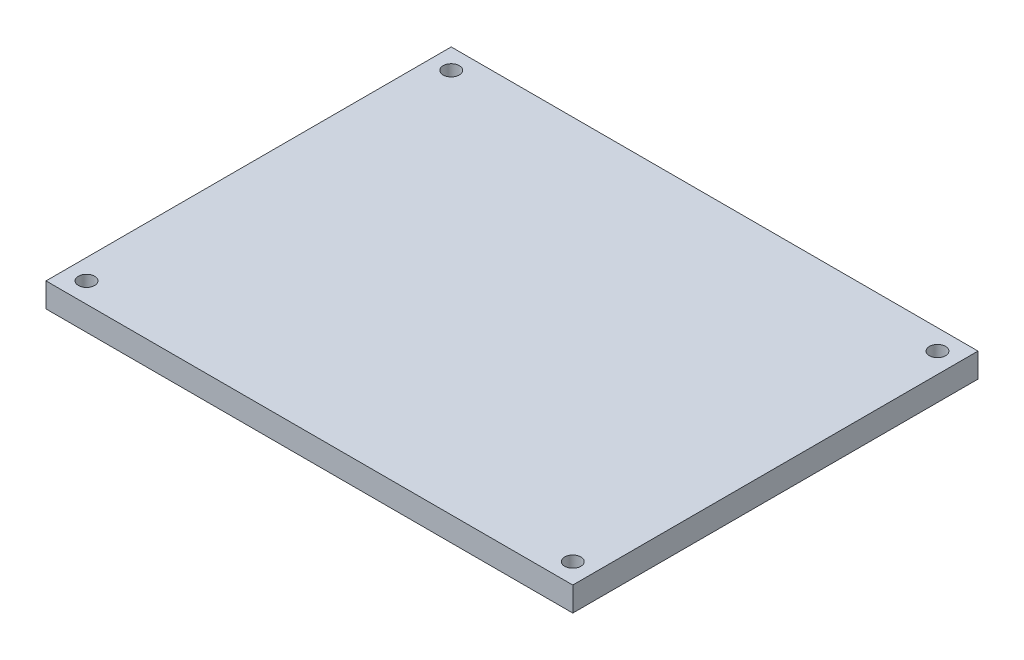
ISO-10303-21;
HEADER;
FILE_DESCRIPTION(('STEP AP214'),'2;1');
FILE_NAME('part.step','',(''),(''),'','','');
FILE_SCHEMA(('AUTOMOTIVE_DESIGN { 1 0 10303 214 1 1 1 1 }'));
ENDSEC;
DATA;
#1=APPLICATION_CONTEXT('core data for automotive mechanical design processes');
#2=APPLICATION_PROTOCOL_DEFINITION('international standard','automotive_design',2000,#1);
#3=PRODUCT_CONTEXT('',#1,'mechanical');
#4=PRODUCT('Part','Part','',(#3));
#5=PRODUCT_RELATED_PRODUCT_CATEGORY('part','',(#4));
#6=PRODUCT_DEFINITION_FORMATION('','',#4);
#7=PRODUCT_DEFINITION_CONTEXT('part definition',#1,'design');
#8=PRODUCT_DEFINITION('design','',#6,#7);
#9=PRODUCT_DEFINITION_SHAPE('','',#8);
#10=(LENGTH_UNIT() NAMED_UNIT(*) SI_UNIT(.MILLI.,.METRE.));
#11=(NAMED_UNIT(*) PLANE_ANGLE_UNIT() SI_UNIT($,.RADIAN.));
#12=(NAMED_UNIT(*) SI_UNIT($,.STERADIAN.) SOLID_ANGLE_UNIT());
#13=UNCERTAINTY_MEASURE_WITH_UNIT(LENGTH_MEASURE(1.E-05),#10,'distance_accuracy_value','');
#14=(GEOMETRIC_REPRESENTATION_CONTEXT(3) GLOBAL_UNCERTAINTY_ASSIGNED_CONTEXT((#13)) GLOBAL_UNIT_ASSIGNED_CONTEXT((#10,
#11,#12)) REPRESENTATION_CONTEXT('',''));
#15=CARTESIAN_POINT('',(0.,0.,0.));
#16=DIRECTION('',(0.,0.,1.));
#17=DIRECTION('',(1.,0.,0.));
#18=AXIS2_PLACEMENT_3D('',#15,#16,#17);
#19=CARTESIAN_POINT('',(65.,6.,-50.));
#20=DIRECTION('',(-1.,0.,0.));
#21=DIRECTION('',(0.,0.,1.));
#22=AXIS2_PLACEMENT_3D('',#19,#20,#21);
#23=PLANE('',#22);
#24=DIRECTION('',(0.,0.,-1.));
#25=VECTOR('',#24,1.);
#26=CARTESIAN_POINT('',(65.,0.,-50.));
#27=LINE('',#26,#25);
#28=CARTESIAN_POINT('',(65.,0.,50.));
#29=VERTEX_POINT('',#28);
#30=CARTESIAN_POINT('',(65.,0.,-50.));
#31=VERTEX_POINT('',#30);
#32=EDGE_CURVE('E95',#29,#31,#27,.T.);
#33=ORIENTED_EDGE('',*,*,#32,.T.);
#34=DIRECTION('',(0.,-1.,0.));
#35=VECTOR('',#34,1.);
#36=CARTESIAN_POINT('',(65.,6.,-50.));
#37=LINE('',#36,#35);
#38=CARTESIAN_POINT('',(65.,6.,-50.));
#39=VERTEX_POINT('',#38);
#40=EDGE_CURVE('E11',#39,#31,#37,.T.);
#41=ORIENTED_EDGE('',*,*,#40,.F.);
#42=DIRECTION('',(0.,0.,-1.));
#43=VECTOR('',#42,1.);
#44=CARTESIAN_POINT('',(65.,6.,-50.));
#45=LINE('',#44,#43);
#46=CARTESIAN_POINT('',(65.,6.,50.));
#47=VERTEX_POINT('',#46);
#48=EDGE_CURVE('E83',#47,#39,#45,.T.);
#49=ORIENTED_EDGE('',*,*,#48,.F.);
#50=DIRECTION('',(0.,-1.,0.));
#51=VECTOR('',#50,1.);
#52=CARTESIAN_POINT('',(65.,6.,50.));
#53=LINE('',#52,#51);
#54=EDGE_CURVE('E91',#47,#29,#53,.T.);
#55=ORIENTED_EDGE('',*,*,#54,.T.);
#56=EDGE_LOOP('',(#33,#41,#49,#55));
#57=FACE_BOUND('',#56,.T.);
#58=ADVANCED_FACE('F32',(#57),#23,.F.);
#59=CARTESIAN_POINT('',(-65.,6.,-50.));
#60=DIRECTION('',(0.,0.,1.));
#61=DIRECTION('',(1.,0.,0.));
#62=AXIS2_PLACEMENT_3D('',#59,#60,#61);
#63=PLANE('',#62);
#64=DIRECTION('',(-1.,0.,0.));
#65=VECTOR('',#64,1.);
#66=CARTESIAN_POINT('',(-65.,0.,-50.));
#67=LINE('',#66,#65);
#68=CARTESIAN_POINT('',(-65.,0.,-50.));
#69=VERTEX_POINT('',#68);
#70=EDGE_CURVE('E87',#31,#69,#67,.T.);
#71=ORIENTED_EDGE('',*,*,#70,.T.);
#72=DIRECTION('',(0.,-1.,0.));
#73=VECTOR('',#72,1.);
#74=CARTESIAN_POINT('',(-65.,6.,-50.));
#75=LINE('',#74,#73);
#76=CARTESIAN_POINT('',(-65.,6.,-50.));
#77=VERTEX_POINT('',#76);
#78=EDGE_CURVE('E40',#77,#69,#75,.T.);
#79=ORIENTED_EDGE('',*,*,#78,.F.);
#80=DIRECTION('',(-1.,0.,0.));
#81=VECTOR('',#80,1.);
#82=CARTESIAN_POINT('',(-65.,6.,-50.));
#83=LINE('',#82,#81);
#84=EDGE_CURVE('E78',#39,#77,#83,.T.);
#85=ORIENTED_EDGE('',*,*,#84,.F.);
#86=ORIENTED_EDGE('',*,*,#40,.T.);
#87=EDGE_LOOP('',(#71,#79,#85,#86));
#88=FACE_BOUND('',#87,.T.);
#89=ADVANCED_FACE('F86',(#88),#63,.F.);
#90=CARTESIAN_POINT('',(-65.,6.,-50.));
#91=DIRECTION('',(1.,0.,0.));
#92=DIRECTION('',(0.,0.,-1.));
#93=AXIS2_PLACEMENT_3D('',#90,#91,#92);
#94=PLANE('',#93);
#95=DIRECTION('',(0.,0.,1.));
#96=VECTOR('',#95,1.);
#97=CARTESIAN_POINT('',(-65.,0.,-50.));
#98=LINE('',#97,#96);
#99=CARTESIAN_POINT('',(-64.9999999999999,0.,50.));
#100=VERTEX_POINT('',#99);
#101=EDGE_CURVE('E65',#69,#100,#98,.T.);
#102=ORIENTED_EDGE('',*,*,#101,.T.);
#103=DIRECTION('',(0.,-1.,0.));
#104=VECTOR('',#103,1.);
#105=CARTESIAN_POINT('',(-64.9999999999999,6.,50.));
#106=LINE('',#105,#104);
#107=CARTESIAN_POINT('',(-64.9999999999999,6.,50.));
#108=VERTEX_POINT('',#107);
#109=EDGE_CURVE('E88',#108,#100,#106,.T.);
#110=ORIENTED_EDGE('',*,*,#109,.F.);
#111=DIRECTION('',(0.,0.,1.));
#112=VECTOR('',#111,1.);
#113=CARTESIAN_POINT('',(-65.,6.,-50.));
#114=LINE('',#113,#112);
#115=EDGE_CURVE('E81',#77,#108,#114,.T.);
#116=ORIENTED_EDGE('',*,*,#115,.F.);
#117=ORIENTED_EDGE('',*,*,#78,.T.);
#118=EDGE_LOOP('',(#102,#110,#116,#117));
#119=FACE_BOUND('',#118,.T.);
#120=ADVANCED_FACE('F89',(#119),#94,.F.);
#121=CARTESIAN_POINT('',(-64.9999999999999,6.,50.));
#122=DIRECTION('',(0.,0.,-1.));
#123=DIRECTION('',(-1.,0.,0.));
#124=AXIS2_PLACEMENT_3D('',#121,#122,#123);
#125=PLANE('',#124);
#126=DIRECTION('',(1.,0.,0.));
#127=VECTOR('',#126,1.);
#128=CARTESIAN_POINT('',(-64.9999999999999,0.,50.));
#129=LINE('',#128,#127);
#130=EDGE_CURVE('E71',#100,#29,#129,.T.);
#131=ORIENTED_EDGE('',*,*,#130,.T.);
#132=ORIENTED_EDGE('',*,*,#54,.F.);
#133=DIRECTION('',(1.,0.,0.));
#134=VECTOR('',#133,1.);
#135=CARTESIAN_POINT('',(-64.9999999999999,6.,50.));
#136=LINE('',#135,#134);
#137=EDGE_CURVE('E48',#108,#47,#136,.T.);
#138=ORIENTED_EDGE('',*,*,#137,.F.);
#139=ORIENTED_EDGE('',*,*,#109,.T.);
#140=EDGE_LOOP('',(#131,#132,#138,#139));
#141=FACE_BOUND('',#140,.T.);
#142=ADVANCED_FACE('F103',(#141),#125,.F.);
#143=CARTESIAN_POINT('',(0.,6.,0.));
#144=DIRECTION('',(0.,1.,0.));
#145=DIRECTION('',(0.,0.,1.));
#146=AXIS2_PLACEMENT_3D('',#143,#144,#145);
#147=PLANE('',#146);
#148=CARTESIAN_POINT('',(-60.,6.,45.));
#149=DIRECTION('',(0.,1.,0.));
#150=DIRECTION('',(0.,0.,-1.));
#151=AXIS2_PLACEMENT_3D('',#148,#149,#150);
#152=CIRCLE('',#151,2.);
#153=CARTESIAN_POINT('',(-60.,6.,43.));
#154=VERTEX_POINT('',#153);
#155=EDGE_CURVE('E127',#154,#154,#152,.T.);
#156=ORIENTED_EDGE('',*,*,#155,.F.);
#157=EDGE_LOOP('',(#156));
#158=FACE_BOUND('',#157,.T.);
#159=CARTESIAN_POINT('',(60.,6.,45.));
#160=DIRECTION('',(0.,1.,0.));
#161=DIRECTION('',(0.,0.,1.));
#162=AXIS2_PLACEMENT_3D('',#159,#160,#161);
#163=CIRCLE('',#162,2.);
#164=CARTESIAN_POINT('',(60.,6.,47.));
#165=VERTEX_POINT('',#164);
#166=EDGE_CURVE('E121',#165,#165,#163,.T.);
#167=ORIENTED_EDGE('',*,*,#166,.F.);
#168=EDGE_LOOP('',(#167));
#169=FACE_BOUND('',#168,.T.);
#170=CARTESIAN_POINT('',(60.,6.,-45.));
#171=DIRECTION('',(0.,1.,0.));
#172=DIRECTION('',(0.,0.,-1.));
#173=AXIS2_PLACEMENT_3D('',#170,#171,#172);
#174=CIRCLE('',#173,2.);
#175=CARTESIAN_POINT('',(60.,6.,-47.));
#176=VERTEX_POINT('',#175);
#177=EDGE_CURVE('E115',#176,#176,#174,.T.);
#178=ORIENTED_EDGE('',*,*,#177,.F.);
#179=EDGE_LOOP('',(#178));
#180=FACE_BOUND('',#179,.T.);
#181=CARTESIAN_POINT('',(-60.,6.,-45.));
#182=DIRECTION('',(0.,1.,0.));
#183=DIRECTION('',(0.,0.,1.));
#184=AXIS2_PLACEMENT_3D('',#181,#182,#183);
#185=CIRCLE('',#184,2.);
#186=CARTESIAN_POINT('',(-60.,6.,-43.));
#187=VERTEX_POINT('',#186);
#188=EDGE_CURVE('E109',#187,#187,#185,.T.);
#189=ORIENTED_EDGE('',*,*,#188,.F.);
#190=EDGE_LOOP('',(#189));
#191=FACE_BOUND('',#190,.T.);
#192=ORIENTED_EDGE('',*,*,#48,.T.);
#193=ORIENTED_EDGE('',*,*,#84,.T.);
#194=ORIENTED_EDGE('',*,*,#115,.T.);
#195=ORIENTED_EDGE('',*,*,#137,.T.);
#196=EDGE_LOOP('',(#192,#193,#194,#195));
#197=FACE_BOUND('',#196,.T.);
#198=ADVANCED_FACE('F79',(#158,#169,#180,#191,#197),#147,.T.);
#199=CARTESIAN_POINT('',(0.,0.,0.));
#200=DIRECTION('',(0.,1.,0.));
#201=DIRECTION('',(0.,0.,1.));
#202=AXIS2_PLACEMENT_3D('',#199,#200,#201);
#203=PLANE('',#202);
#204=CARTESIAN_POINT('',(-60.,0.,45.));
#205=DIRECTION('',(0.,1.,0.));
#206=DIRECTION('',(0.,0.,-1.));
#207=AXIS2_PLACEMENT_3D('',#204,#205,#206);
#208=CIRCLE('',#207,2.);
#209=CARTESIAN_POINT('',(-60.,0.,43.));
#210=VERTEX_POINT('',#209);
#211=EDGE_CURVE('E112',#210,#210,#208,.T.);
#212=ORIENTED_EDGE('',*,*,#211,.T.);
#213=EDGE_LOOP('',(#212));
#214=FACE_BOUND('',#213,.T.);
#215=CARTESIAN_POINT('',(60.,0.,45.));
#216=DIRECTION('',(0.,1.,0.));
#217=DIRECTION('',(0.,0.,1.));
#218=AXIS2_PLACEMENT_3D('',#215,#216,#217);
#219=CIRCLE('',#218,2.);
#220=CARTESIAN_POINT('',(60.,0.,47.));
#221=VERTEX_POINT('',#220);
#222=EDGE_CURVE('E124',#221,#221,#219,.T.);
#223=ORIENTED_EDGE('',*,*,#222,.T.);
#224=EDGE_LOOP('',(#223));
#225=FACE_BOUND('',#224,.T.);
#226=CARTESIAN_POINT('',(60.,0.,-45.));
#227=DIRECTION('',(0.,1.,0.));
#228=DIRECTION('',(0.,0.,-1.));
#229=AXIS2_PLACEMENT_3D('',#226,#227,#228);
#230=CIRCLE('',#229,2.);
#231=CARTESIAN_POINT('',(60.,0.,-47.));
#232=VERTEX_POINT('',#231);
#233=EDGE_CURVE('E118',#232,#232,#230,.T.);
#234=ORIENTED_EDGE('',*,*,#233,.T.);
#235=EDGE_LOOP('',(#234));
#236=FACE_BOUND('',#235,.T.);
#237=CARTESIAN_POINT('',(-60.,0.,-45.));
#238=DIRECTION('',(0.,1.,0.));
#239=DIRECTION('',(0.,0.,1.));
#240=AXIS2_PLACEMENT_3D('',#237,#238,#239);
#241=CIRCLE('',#240,2.);
#242=CARTESIAN_POINT('',(-60.,0.,-43.));
#243=VERTEX_POINT('',#242);
#244=EDGE_CURVE('E98',#243,#243,#241,.T.);
#245=ORIENTED_EDGE('',*,*,#244,.T.);
#246=EDGE_LOOP('',(#245));
#247=FACE_BOUND('',#246,.T.);
#248=ORIENTED_EDGE('',*,*,#32,.F.);
#249=ORIENTED_EDGE('',*,*,#130,.F.);
#250=ORIENTED_EDGE('',*,*,#101,.F.);
#251=ORIENTED_EDGE('',*,*,#70,.F.);
#252=EDGE_LOOP('',(#248,#249,#250,#251));
#253=FACE_BOUND('',#252,.T.);
#254=ADVANCED_FACE('F106',(#214,#225,#236,#247,#253),#203,.F.);
#255=CARTESIAN_POINT('',(-60.,0.,-45.));
#256=DIRECTION('',(0.,1.,0.));
#257=DIRECTION('',(0.,0.,1.));
#258=AXIS2_PLACEMENT_3D('',#255,#256,#257);
#259=CYLINDRICAL_SURFACE('',#258,2.);
#260=ORIENTED_EDGE('',*,*,#244,.F.);
#261=EDGE_LOOP('',(#260));
#262=FACE_BOUND('',#261,.T.);
#263=ORIENTED_EDGE('',*,*,#188,.T.);
#264=EDGE_LOOP('',(#263));
#265=FACE_BOUND('',#264,.T.);
#266=ADVANCED_FACE('F151',(#262,#265),#259,.F.);
#267=CARTESIAN_POINT('',(60.,0.,-45.));
#268=DIRECTION('',(0.,1.,0.));
#269=DIRECTION('',(0.,0.,1.));
#270=AXIS2_PLACEMENT_3D('',#267,#268,#269);
#271=CYLINDRICAL_SURFACE('',#270,2.);
#272=ORIENTED_EDGE('',*,*,#233,.F.);
#273=EDGE_LOOP('',(#272));
#274=FACE_BOUND('',#273,.T.);
#275=ORIENTED_EDGE('',*,*,#177,.T.);
#276=EDGE_LOOP('',(#275));
#277=FACE_BOUND('',#276,.T.);
#278=ADVANCED_FACE('F153',(#274,#277),#271,.F.);
#279=CARTESIAN_POINT('',(60.,0.,45.));
#280=DIRECTION('',(0.,1.,0.));
#281=DIRECTION('',(0.,0.,1.));
#282=AXIS2_PLACEMENT_3D('',#279,#280,#281);
#283=CYLINDRICAL_SURFACE('',#282,2.);
#284=ORIENTED_EDGE('',*,*,#222,.F.);
#285=EDGE_LOOP('',(#284));
#286=FACE_BOUND('',#285,.T.);
#287=ORIENTED_EDGE('',*,*,#166,.T.);
#288=EDGE_LOOP('',(#287));
#289=FACE_BOUND('',#288,.T.);
#290=ADVANCED_FACE('F138',(#286,#289),#283,.F.);
#291=CARTESIAN_POINT('',(-60.,0.,45.));
#292=DIRECTION('',(0.,1.,0.));
#293=DIRECTION('',(0.,0.,1.));
#294=AXIS2_PLACEMENT_3D('',#291,#292,#293);
#295=CYLINDRICAL_SURFACE('',#294,2.);
#296=ORIENTED_EDGE('',*,*,#211,.F.);
#297=EDGE_LOOP('',(#296));
#298=FACE_BOUND('',#297,.T.);
#299=ORIENTED_EDGE('',*,*,#155,.T.);
#300=EDGE_LOOP('',(#299));
#301=FACE_BOUND('',#300,.T.);
#302=ADVANCED_FACE('F135',(#298,#301),#295,.F.);
#303=CLOSED_SHELL('',(#58,#89,#120,#142,#198,#254,#266,#278,#290,#302));
#304=MANIFOLD_SOLID_BREP('B2',#303);
#305=ADVANCED_BREP_SHAPE_REPRESENTATION('',(#18,#304),#14);
#306=SHAPE_DEFINITION_REPRESENTATION(#9,#305);
ENDSEC;
END-ISO-10303-21;
